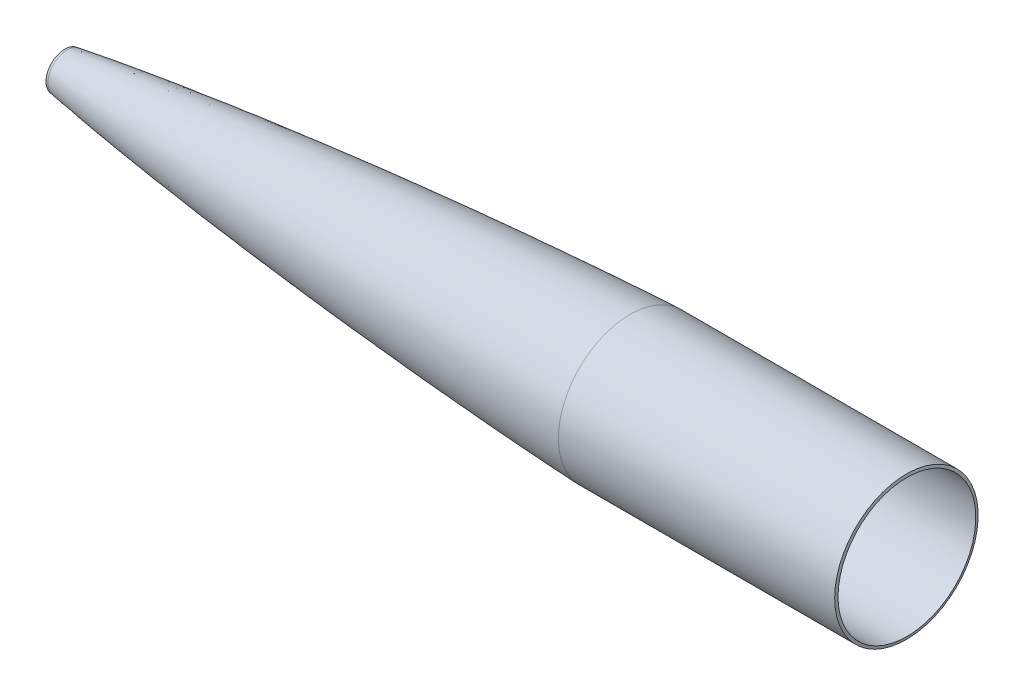
ISO-10303-21;
HEADER;
FILE_DESCRIPTION(('STEP AP214'),'2;1');
FILE_NAME('part.step','',(''),(''),'','','');
FILE_SCHEMA(('AUTOMOTIVE_DESIGN { 1 0 10303 214 1 1 1 1 }'));
ENDSEC;
DATA;
#1=APPLICATION_CONTEXT('core data for automotive mechanical design processes');
#2=APPLICATION_PROTOCOL_DEFINITION('international standard','automotive_design',2000,#1);
#3=PRODUCT_CONTEXT('',#1,'mechanical');
#4=PRODUCT('Part','Part','',(#3));
#5=PRODUCT_RELATED_PRODUCT_CATEGORY('part','',(#4));
#6=PRODUCT_DEFINITION_FORMATION('','',#4);
#7=PRODUCT_DEFINITION_CONTEXT('part definition',#1,'design');
#8=PRODUCT_DEFINITION('design','',#6,#7);
#9=PRODUCT_DEFINITION_SHAPE('','',#8);
#10=(LENGTH_UNIT() NAMED_UNIT(*) SI_UNIT(.MILLI.,.METRE.));
#11=(NAMED_UNIT(*) PLANE_ANGLE_UNIT() SI_UNIT($,.RADIAN.));
#12=(NAMED_UNIT(*) SI_UNIT($,.STERADIAN.) SOLID_ANGLE_UNIT());
#13=UNCERTAINTY_MEASURE_WITH_UNIT(LENGTH_MEASURE(1.E-05),#10,'distance_accuracy_value','');
#14=(GEOMETRIC_REPRESENTATION_CONTEXT(3) GLOBAL_UNCERTAINTY_ASSIGNED_CONTEXT((#13)) GLOBAL_UNIT_ASSIGNED_CONTEXT((#10,
#11,#12)) REPRESENTATION_CONTEXT('',''));
#15=CARTESIAN_POINT('',(0.,0.,0.));
#16=DIRECTION('',(0.,0.,1.));
#17=DIRECTION('',(1.,0.,0.));
#18=AXIS2_PLACEMENT_3D('',#15,#16,#17);
#19=CARTESIAN_POINT('',(98.7268869622327,0.,-18.3301786992929));
#20=CARTESIAN_POINT('',(113.994878643587,0.,-20.7701328806195));
#21=CARTESIAN_POINT('',(144.577764754279,0.,-25.3306705830481));
#22=CARTESIAN_POINT('',(205.898051252011,0.,-33.5898073164521));
#23=CARTESIAN_POINT('',(282.720170459941,0.,-42.6805212316293));
#24=CARTESIAN_POINT('',(375.073984944278,0.,-52.1767515915719));
#25=CARTESIAN_POINT('',(467.54774705829,0.,-60.4692358769701));
#26=CARTESIAN_POINT('',(560.116293439962,0.,-67.6373936049652));
#27=CARTESIAN_POINT('',(637.322841402014,0.,-72.6532777338232));
#28=CARTESIAN_POINT('',(694.420933949465,0.,-75.7530576428573));
#29=CARTESIAN_POINT('',(720.626011218366,0.,-76.9951436260725));
#30=CARTESIAN_POINT('',(731.378470363669,0.,-77.4700000000105));
#31=B_SPLINE_CURVE_WITH_KNOTS('',3,(#19,#20,#21,#22,#23,#24,#25,#26,#27,#28,#29,#30),
.UNSPECIFIED.,.F.,.F.,(4,1,1,1,1,1,1,1,1,4),(0.119456002324028,0.174490002178776,
0.229524002033525,0.339592001743021,0.449660001452518,0.559728001162014,0.66979600087151,
0.779864000581007,0.834898000435755,0.873185266873102),.UNSPECIFIED.);
#32=CARTESIAN_POINT('',(0.,0.,0.));
#33=DIRECTION('',(-1.,0.,0.));
#34=AXIS1_PLACEMENT('',#32,#33);
#35=SURFACE_OF_REVOLUTION('',#31,#34);
#36=CARTESIAN_POINT('',(118.275863992735,0.,0.));
#37=DIRECTION('',(-1.,0.,0.));
#38=DIRECTION('',(0.,0.,1.));
#39=AXIS2_PLACEMENT_3D('',#36,#37,#38);
#40=CIRCLE('',#39,21.3691557297947);
#41=CARTESIAN_POINT('',(118.275863992735,0.,21.3691557297947));
#42=VERTEX_POINT('',#41);
#43=EDGE_CURVE('E10',#42,#42,#40,.T.);
#44=ORIENTED_EDGE('',*,*,#43,.T.);
#45=EDGE_LOOP('',(#44));
#46=FACE_BOUND('',#45,.T.);
#47=CARTESIAN_POINT('',(731.378470363671,0.,0.));
#48=DIRECTION('',(-1.,0.,0.));
#49=DIRECTION('',(0.,0.,1.));
#50=AXIS2_PLACEMENT_3D('',#47,#48,#49);
#51=CIRCLE('',#50,77.4700000000106);
#52=CARTESIAN_POINT('',(731.378470363671,0.,77.4700000000106));
#53=VERTEX_POINT('',#52);
#54=EDGE_CURVE('E45',#53,#53,#51,.T.);
#55=ORIENTED_EDGE('',*,*,#54,.F.);
#56=EDGE_LOOP('',(#55));
#57=FACE_BOUND('',#56,.T.);
#58=ADVANCED_FACE('F37',(#46,#57),#35,.T.);
#59=CARTESIAN_POINT('',(0.,0.,0.));
#60=DIRECTION('',(-1.,0.,0.));
#61=DIRECTION('',(0.,0.,1.));
#62=AXIS2_PLACEMENT_3D('',#59,#60,#61);
#63=CYLINDRICAL_SURFACE('',#62,77.4700000000052);
#64=CARTESIAN_POINT('',(1042.5196763275,0.,0.));
#65=DIRECTION('',(-1.,0.,0.));
#66=DIRECTION('',(0.,0.,1.));
#67=AXIS2_PLACEMENT_3D('',#64,#65,#66);
#68=CIRCLE('',#67,77.4699999999999);
#69=CARTESIAN_POINT('',(1042.5196763275,0.,77.4699999999999));
#70=VERTEX_POINT('',#69);
#71=EDGE_CURVE('E49',#70,#70,#68,.T.);
#72=ORIENTED_EDGE('',*,*,#71,.F.);
#73=EDGE_LOOP('',(#72));
#74=FACE_BOUND('',#73,.T.);
#75=ORIENTED_EDGE('',*,*,#54,.T.);
#76=EDGE_LOOP('',(#75));
#77=FACE_BOUND('',#76,.T.);
#78=ADVANCED_FACE('F92',(#74,#77),#63,.F.);
#79=CARTESIAN_POINT('',(1042.5196763275,0.,0.));
#80=DIRECTION('',(-1.,0.,0.));
#81=DIRECTION('',(0.,0.,1.));
#82=AXIS2_PLACEMENT_3D('',#79,#80,#81);
#83=CONICAL_SURFACE('',#82,77.4699999999999,1.39626340159543);
#84=CARTESIAN_POINT('',(1041.95983816375,0.,0.));
#85=DIRECTION('',(-1.,0.,0.));
#86=DIRECTION('',(0.,0.,1.));
#87=AXIS2_PLACEMENT_3D('',#84,#85,#86);
#88=CIRCLE('',#87,80.6449999999999);
#89=CARTESIAN_POINT('',(1041.95983816375,0.,80.6449999999999));
#90=VERTEX_POINT('',#89);
#91=EDGE_CURVE('E54',#90,#90,#88,.T.);
#92=ORIENTED_EDGE('',*,*,#91,.F.);
#93=EDGE_LOOP('',(#92));
#94=FACE_BOUND('',#93,.T.);
#95=ORIENTED_EDGE('',*,*,#71,.T.);
#96=EDGE_LOOP('',(#95));
#97=FACE_BOUND('',#96,.T.);
#98=ADVANCED_FACE('F88',(#94,#97),#83,.T.);
#99=CARTESIAN_POINT('',(0.,0.,0.));
#100=DIRECTION('',(-1.,0.,0.));
#101=DIRECTION('',(0.,0.,1.));
#102=AXIS2_PLACEMENT_3D('',#99,#100,#101);
#103=CYLINDRICAL_SURFACE('',#102,80.6450000000052);
#104=CARTESIAN_POINT('',(731.30839641275,0.,0.));
#105=DIRECTION('',(-1.,0.,0.));
#106=DIRECTION('',(0.,0.,1.));
#107=AXIS2_PLACEMENT_3D('',#104,#105,#106);
#108=CIRCLE('',#107,80.6450000000105);
#109=CARTESIAN_POINT('',(731.30839641275,0.,80.6450000000105));
#110=VERTEX_POINT('',#109);
#111=EDGE_CURVE('E57',#110,#110,#108,.T.);
#112=ORIENTED_EDGE('',*,*,#111,.F.);
#113=EDGE_LOOP('',(#112));
#114=FACE_BOUND('',#113,.T.);
#115=ORIENTED_EDGE('',*,*,#91,.T.);
#116=EDGE_LOOP('',(#115));
#117=FACE_BOUND('',#116,.T.);
#118=ADVANCED_FACE('F83',(#114,#117),#103,.T.);
#119=CARTESIAN_POINT('',(731.30839641275,0.,-80.6450000000105));
#120=CARTESIAN_POINT('',(678.351858693668,0.,-78.3063024855373));
#121=CARTESIAN_POINT('',(572.506921448361,0.,-72.0562598698534));
#122=CARTESIAN_POINT('',(413.979840242663,0.,-59.3568380770001));
#123=CARTESIAN_POINT('',(282.119502984153,0.,-46.0132485717114));
#124=CARTESIAN_POINT('',(176.884669484574,0.,-33.1097366534976));
#125=CARTESIAN_POINT('',(124.397667511447,0.,-25.6478736656115));
#126=CARTESIAN_POINT('',(98.2258526713109,0.,-21.4653963375631));
#127=B_SPLINE_CURVE_WITH_KNOTS('',3,(#119,#120,#121,#122,#123,#124,#125,#126),.UNSPECIFIED.,.F.,
.F.,(4,1,1,1,1,4),(0.119456002324028,0.307909091442152,0.496362180560275,0.684815269678399,
0.779041814237461,0.873268358796523),.UNSPECIFIED.);
#128=CARTESIAN_POINT('',(0.,0.,0.));
#129=DIRECTION('',(-1.,0.,0.));
#130=AXIS1_PLACEMENT('',#128,#129);
#131=SURFACE_OF_REVOLUTION('',#127,#130);
#132=CARTESIAN_POINT('',(98.2258526713109,0.,0.));
#133=DIRECTION('',(-1.,0.,0.));
#134=DIRECTION('',(0.,0.,1.));
#135=AXIS2_PLACEMENT_3D('',#132,#133,#134);
#136=CIRCLE('',#135,21.4653963375631);
#137=CARTESIAN_POINT('',(98.2258526713109,0.,21.4653963375631));
#138=VERTEX_POINT('',#137);
#139=EDGE_CURVE('E60',#138,#138,#136,.T.);
#140=ORIENTED_EDGE('',*,*,#139,.F.);
#141=EDGE_LOOP('',(#140));
#142=FACE_BOUND('',#141,.T.);
#143=ORIENTED_EDGE('',*,*,#111,.T.);
#144=EDGE_LOOP('',(#143));
#145=FACE_BOUND('',#144,.T.);
#146=ADVANCED_FACE('F78',(#142,#145),#131,.T.);
#147=CARTESIAN_POINT('',(98.2258526713109,0.,0.));
#148=DIRECTION('',(1.,0.,0.));
#149=DIRECTION('',(0.,0.,-1.));
#150=AXIS2_PLACEMENT_3D('',#147,#148,#149);
#151=CONICAL_SURFACE('',#150,21.4653963375631,0.158938392423921);
#152=CARTESIAN_POINT('',(95.684220755413,0.,0.));
#153=DIRECTION('',(-1.,0.,0.));
#154=DIRECTION('',(0.,0.,1.));
#155=AXIS2_PLACEMENT_3D('',#152,#153,#154);
#156=CIRCLE('',#155,21.0579971626276);
#157=CARTESIAN_POINT('',(95.684220755413,0.,21.0579971626276));
#158=VERTEX_POINT('',#157);
#159=EDGE_CURVE('E63',#158,#158,#156,.T.);
#160=ORIENTED_EDGE('',*,*,#159,.F.);
#161=EDGE_LOOP('',(#160));
#162=FACE_BOUND('',#161,.T.);
#163=ORIENTED_EDGE('',*,*,#139,.T.);
#164=EDGE_LOOP('',(#163));
#165=FACE_BOUND('',#164,.T.);
#166=ADVANCED_FACE('F82',(#162,#165),#151,.T.);
#167=CARTESIAN_POINT('',(95.684220755413,0.,1.1757878873259E-13));
#168=DIRECTION('',(1.,0.,0.));
#169=DIRECTION('',(0.,0.,-1.));
#170=AXIS2_PLACEMENT_3D('',#167,#168,#169);
#171=PLANE('',#170);
#172=CARTESIAN_POINT('',(95.684220755413,0.,0.));
#173=DIRECTION('',(-1.,0.,0.));
#174=DIRECTION('',(0.,0.,1.));
#175=AXIS2_PLACEMENT_3D('',#172,#173,#174);
#176=CIRCLE('',#175,12.25);
#177=CARTESIAN_POINT('',(95.684220755413,0.,12.25));
#178=VERTEX_POINT('',#177);
#179=EDGE_CURVE('E168',#178,#178,#176,.T.);
#180=ORIENTED_EDGE('',*,*,#179,.F.);
#181=EDGE_LOOP('',(#180));
#182=FACE_BOUND('',#181,.T.);
#183=ORIENTED_EDGE('',*,*,#159,.T.);
#184=EDGE_LOOP('',(#183));
#185=FACE_BOUND('',#184,.T.);
#186=ADVANCED_FACE('F125',(#182,#185),#171,.F.);
#187=CARTESIAN_POINT('',(118.275863992735,0.,0.));
#188=DIRECTION('',(1.,0.,0.));
#189=DIRECTION('',(0.,0.,-1.));
#190=AXIS2_PLACEMENT_3D('',#187,#188,#189);
#191=CONICAL_SURFACE('',#190,21.3691557297947,0.785398163397445);
#192=CARTESIAN_POINT('',(109.15670826294,0.,0.));
#193=DIRECTION('',(1.,0.,0.));
#194=DIRECTION('',(0.,0.,-1.));
#195=AXIS2_PLACEMENT_3D('',#192,#193,#194);
#196=CIRCLE('',#195,12.25);
#197=CARTESIAN_POINT('',(109.15670826294,0.,12.25));
#198=VERTEX_POINT('',#197);
#199=EDGE_CURVE('E41',#198,#198,#196,.F.);
#200=ORIENTED_EDGE('',*,*,#199,.T.);
#201=EDGE_LOOP('',(#200));
#202=FACE_BOUND('',#201,.T.);
#203=ORIENTED_EDGE('',*,*,#43,.F.);
#204=EDGE_LOOP('',(#203));
#205=FACE_BOUND('',#204,.T.);
#206=ADVANCED_FACE('F39',(#202,#205),#191,.F.);
#207=CARTESIAN_POINT('',(260.684220755413,0.,0.));
#208=DIRECTION('',(-1.,0.,0.));
#209=DIRECTION('',(0.,0.,1.));
#210=AXIS2_PLACEMENT_3D('',#207,#208,#209);
#211=CYLINDRICAL_SURFACE('',#210,12.25);
#212=CARTESIAN_POINT('',(95.684220755413,0.,12.25));
#213=CARTESIAN_POINT('',(95.8245591669498,0.,12.25));
#214=CARTESIAN_POINT('',(95.9648975784865,0.,12.25));
#215=CARTESIAN_POINT('',(96.24557440156,0.,12.25));
#216=CARTESIAN_POINT('',(96.3859128130967,0.,12.25));
#217=CARTESIAN_POINT('',(96.6665896361702,0.,12.25));
#218=CARTESIAN_POINT('',(96.8069280477069,0.,12.25));
#219=CARTESIAN_POINT('',(97.0876048707804,0.,12.25));
#220=CARTESIAN_POINT('',(97.2279432823171,0.,12.25));
#221=CARTESIAN_POINT('',(97.5086201053906,0.,12.25));
#222=CARTESIAN_POINT('',(97.6489585169273,0.,12.25));
#223=CARTESIAN_POINT('',(97.9296353400008,0.,12.25));
#224=CARTESIAN_POINT('',(98.0699737515376,0.,12.25));
#225=CARTESIAN_POINT('',(98.350650574611,0.,12.25));
#226=CARTESIAN_POINT('',(98.4909889861478,0.,12.25));
#227=CARTESIAN_POINT('',(98.7716658092212,0.,12.25));
#228=CARTESIAN_POINT('',(98.912004220758,0.,12.25));
#229=CARTESIAN_POINT('',(99.1926810438314,0.,12.25));
#230=CARTESIAN_POINT('',(99.3330194553682,0.,12.25));
#231=CARTESIAN_POINT('',(99.6136962784417,0.,12.25));
#232=CARTESIAN_POINT('',(99.7540346899784,0.,12.25));
#233=CARTESIAN_POINT('',(100.034711513052,0.,12.25));
#234=CARTESIAN_POINT('',(100.175049924589,0.,12.25));
#235=CARTESIAN_POINT('',(100.455726747662,0.,12.25));
#236=CARTESIAN_POINT('',(100.596065159199,0.,12.25));
#237=CARTESIAN_POINT('',(100.876741982272,0.,12.25));
#238=CARTESIAN_POINT('',(101.017080393809,0.,12.25));
#239=CARTESIAN_POINT('',(101.297757216883,0.,12.25));
#240=CARTESIAN_POINT('',(101.438095628419,0.,12.25));
#241=CARTESIAN_POINT('',(101.718772451493,0.,12.25));
#242=CARTESIAN_POINT('',(101.859110863029,0.,12.25));
#243=CARTESIAN_POINT('',(102.139787686103,0.,12.25));
#244=CARTESIAN_POINT('',(102.28012609764,0.,12.25));
#245=CARTESIAN_POINT('',(102.560802920713,0.,12.25));
#246=CARTESIAN_POINT('',(102.70114133225,0.,12.25));
#247=CARTESIAN_POINT('',(102.981818155323,0.,12.25));
#248=CARTESIAN_POINT('',(103.12215656686,0.,12.25));
#249=CARTESIAN_POINT('',(103.402833389934,0.,12.25));
#250=CARTESIAN_POINT('',(103.54317180147,0.,12.25));
#251=CARTESIAN_POINT('',(103.823848624544,0.,12.25));
#252=CARTESIAN_POINT('',(103.964187036081,0.,12.25));
#253=CARTESIAN_POINT('',(104.244863859154,0.,12.25));
#254=CARTESIAN_POINT('',(104.385202270691,0.,12.25));
#255=CARTESIAN_POINT('',(104.665879093764,0.,12.25));
#256=CARTESIAN_POINT('',(104.806217505301,0.,12.25));
#257=CARTESIAN_POINT('',(105.086894328374,0.,12.25));
#258=CARTESIAN_POINT('',(105.227232739911,0.,12.25));
#259=CARTESIAN_POINT('',(105.507909562985,0.,12.25));
#260=CARTESIAN_POINT('',(105.648247974521,0.,12.25));
#261=CARTESIAN_POINT('',(105.928924797595,0.,12.25));
#262=CARTESIAN_POINT('',(106.069263209132,0.,12.25));
#263=CARTESIAN_POINT('',(106.349940032205,0.,12.25));
#264=CARTESIAN_POINT('',(106.490278443742,0.,12.25));
#265=CARTESIAN_POINT('',(106.770955266815,0.,12.25));
#266=CARTESIAN_POINT('',(106.911293678352,0.,12.25));
#267=CARTESIAN_POINT('',(107.191970501425,0.,12.25));
#268=CARTESIAN_POINT('',(107.332308912962,0.,12.25));
#269=CARTESIAN_POINT('',(107.612985736036,0.,12.25));
#270=CARTESIAN_POINT('',(107.753324147572,0.,12.25));
#271=CARTESIAN_POINT('',(108.034000970646,0.,12.25));
#272=CARTESIAN_POINT('',(108.174339382183,0.,12.25));
#273=CARTESIAN_POINT('',(108.455016205256,0.,12.25));
#274=CARTESIAN_POINT('',(108.595354616793,0.,12.25));
#275=CARTESIAN_POINT('',(108.876031439866,0.,12.25));
#276=CARTESIAN_POINT('',(109.016369851403,0.,12.25));
#277=CARTESIAN_POINT('',(109.15670826294,0.,12.25));
#278=B_SPLINE_CURVE_WITH_KNOTS('',3,(#212,#213,#214,#215,#216,#217,#218,#219,#220,#221,#222,
#223,#224,#225,#226,#227,#228,#229,#230,#231,#232,#233,#234,#235,#236,#237,#238,#239,#240,#241,
#242,#243,#244,#245,#246,#247,#248,#249,#250,#251,#252,#253,#254,#255,#256,#257,#258,#259,#260,
#261,#262,#263,#264,#265,#266,#267,#268,#269,#270,#271,#272,#273,#274,#275,#276,#277),
.UNSPECIFIED.,.F.,.F.,(4,2,2,2,2,2,2,2,2,2,2,2,2,2,2,2,2,2,2,2,2,2,2,2,2,2,2,2,2,2,2,2,4),(0.,
0.421015234610217,0.842030469220434,1.26304570383062,1.68406093844084,2.10507617305106,
2.52609140766127,2.94710664227149,3.36812187688168,3.7891371114919,4.21015234610211,
4.63116758071233,5.05218281532255,5.47319804993276,5.89421328454295,6.31522851915317,
6.73624375376339,7.1572589883736,7.57827422298382,7.99928945759401,8.42030469220423,
8.84131992681444,9.26233516142466,9.68335039603488,10.1043656306451,10.5253808652553,
10.9463960998655,11.3674113344757,11.7884265690859,12.2094418036962,12.6304570383063,
13.0514722729166,13.4724875075268),.UNSPECIFIED.);
#279=EDGE_CURVE('BSEAM137',#178,#198,#278,.T.);
#280=ORIENTED_EDGE('',*,*,#179,.T.);
#281=ORIENTED_EDGE('',*,*,#199,.F.);
#282=ORIENTED_EDGE('',*,*,#279,.T.);
#283=ORIENTED_EDGE('',*,*,#279,.F.);
#284=EDGE_LOOP('',(#280,#282,#281,#283));
#285=FACE_BOUND('',#284,.T.);
#286=ADVANCED_FACE('F137',(#285),#211,.F.);
#287=CLOSED_SHELL('',(#58,#78,#98,#118,#146,#166,#186,#206,#286));
#288=MANIFOLD_SOLID_BREP('B2',#287);
#289=ADVANCED_BREP_SHAPE_REPRESENTATION('',(#18,#288),#14);
#290=SHAPE_DEFINITION_REPRESENTATION(#9,#289);
ENDSEC;
END-ISO-10303-21;
